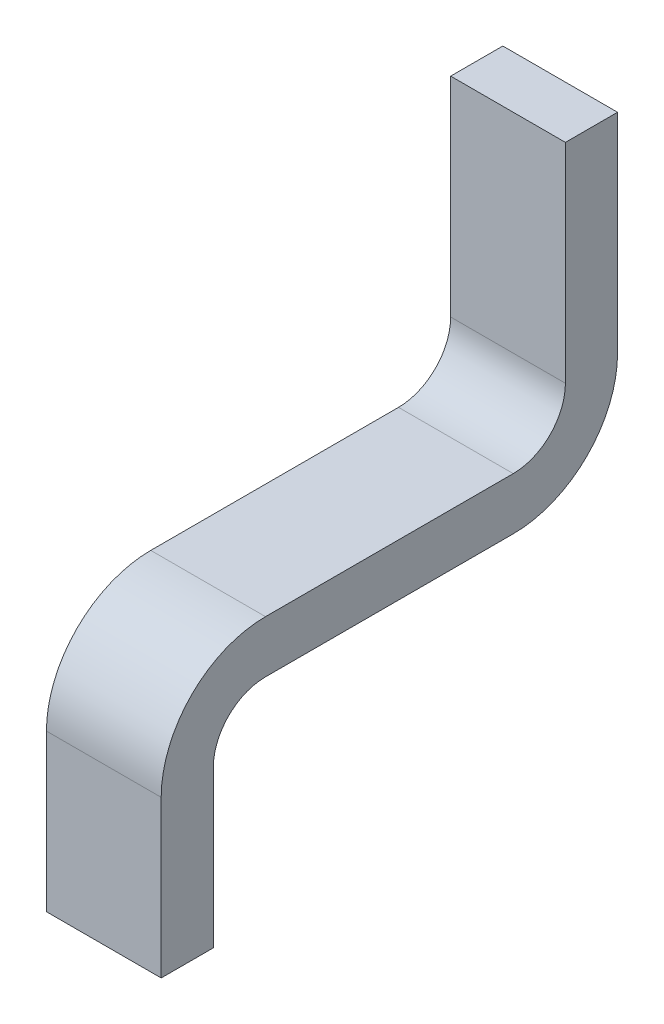
ISO-10303-21;
HEADER;
FILE_DESCRIPTION(('STEP AP214'),'2;1');
FILE_NAME('part.step','',(''),(''),'','','');
FILE_SCHEMA(('AUTOMOTIVE_DESIGN { 1 0 10303 214 1 1 1 1 }'));
ENDSEC;
DATA;
#1=APPLICATION_CONTEXT('core data for automotive mechanical design processes');
#2=APPLICATION_PROTOCOL_DEFINITION('international standard','automotive_design',2000,#1);
#3=PRODUCT_CONTEXT('',#1,'mechanical');
#4=PRODUCT('Part','Part','',(#3));
#5=PRODUCT_RELATED_PRODUCT_CATEGORY('part','',(#4));
#6=PRODUCT_DEFINITION_FORMATION('','',#4);
#7=PRODUCT_DEFINITION_CONTEXT('part definition',#1,'design');
#8=PRODUCT_DEFINITION('design','',#6,#7);
#9=PRODUCT_DEFINITION_SHAPE('','',#8);
#10=(LENGTH_UNIT() NAMED_UNIT(*) SI_UNIT(.MILLI.,.METRE.));
#11=(NAMED_UNIT(*) PLANE_ANGLE_UNIT() SI_UNIT($,.RADIAN.));
#12=(NAMED_UNIT(*) SI_UNIT($,.STERADIAN.) SOLID_ANGLE_UNIT());
#13=UNCERTAINTY_MEASURE_WITH_UNIT(LENGTH_MEASURE(1.E-05),#10,'distance_accuracy_value','');
#14=(GEOMETRIC_REPRESENTATION_CONTEXT(3) GLOBAL_UNCERTAINTY_ASSIGNED_CONTEXT((#13)) GLOBAL_UNIT_ASSIGNED_CONTEXT((#10,
#11,#12)) REPRESENTATION_CONTEXT('',''));
#15=CARTESIAN_POINT('',(0.,0.,0.));
#16=DIRECTION('',(0.,0.,1.));
#17=DIRECTION('',(1.,0.,0.));
#18=AXIS2_PLACEMENT_3D('',#15,#16,#17);
#19=CARTESIAN_POINT('',(-1.64,4.,0.675));
#20=DIRECTION('',(-1.,0.,0.));
#21=DIRECTION('',(0.,-1.,0.));
#22=AXIS2_PLACEMENT_3D('',#19,#20,#21);
#23=PLANE('',#22);
#24=CARTESIAN_POINT('',(-1.64,3.8,0.675));
#25=DIRECTION('',(1.,0.,0.));
#26=DIRECTION('',(0.,1.,0.));
#27=AXIS2_PLACEMENT_3D('',#24,#25,#26);
#28=CIRCLE('',#27,0.2);
#29=CARTESIAN_POINT('',(-1.64,3.8,0.875));
#30=VERTEX_POINT('',#29);
#31=CARTESIAN_POINT('',(-1.64,4.,0.675));
#32=VERTEX_POINT('',#31);
#33=EDGE_CURVE('E150',#30,#32,#28,.F.);
#34=ORIENTED_EDGE('',*,*,#33,.F.);
#35=DIRECTION('',(0.,1.,0.));
#36=VECTOR('',#35,1.);
#37=CARTESIAN_POINT('',(-1.64,3.50000000000001,0.875));
#38=LINE('',#37,#36);
#39=CARTESIAN_POINT('',(-1.64,3.50000000000001,0.875));
#40=VERTEX_POINT('',#39);
#41=EDGE_CURVE('E147',#30,#40,#38,.F.);
#42=ORIENTED_EDGE('',*,*,#41,.T.);
#43=DIRECTION('',(0.,0.,1.));
#44=VECTOR('',#43,1.);
#45=CARTESIAN_POINT('',(-1.64,3.50000000000001,0.775));
#46=LINE('',#45,#44);
#47=CARTESIAN_POINT('',(-1.64,3.50000000000001,0.775));
#48=VERTEX_POINT('',#47);
#49=EDGE_CURVE('E141',#48,#40,#46,.T.);
#50=ORIENTED_EDGE('',*,*,#49,.F.);
#51=DIRECTION('',(0.,1.,0.));
#52=VECTOR('',#51,1.);
#53=CARTESIAN_POINT('',(-1.64,3.50000000000001,0.775));
#54=LINE('',#53,#52);
#55=CARTESIAN_POINT('',(-1.64,3.8,0.775));
#56=VERTEX_POINT('',#55);
#57=EDGE_CURVE('E115',#48,#56,#54,.T.);
#58=ORIENTED_EDGE('',*,*,#57,.T.);
#59=CARTESIAN_POINT('',(-1.64,3.8,0.675));
#60=DIRECTION('',(1.,0.,0.));
#61=DIRECTION('',(0.,1.,0.));
#62=AXIS2_PLACEMENT_3D('',#59,#60,#61);
#63=CIRCLE('',#62,0.1);
#64=CARTESIAN_POINT('',(-1.64,3.90000000000001,0.675));
#65=VERTEX_POINT('',#64);
#66=EDGE_CURVE('E215',#56,#65,#63,.F.);
#67=ORIENTED_EDGE('',*,*,#66,.T.);
#68=DIRECTION('',(0.,0.,1.));
#69=VECTOR('',#68,1.);
#70=CARTESIAN_POINT('',(-1.64,3.90000000000001,0.675));
#71=LINE('',#70,#69);
#72=CARTESIAN_POINT('',(-1.64,3.90000000000001,0.2));
#73=VERTEX_POINT('',#72);
#74=EDGE_CURVE('E181',#65,#73,#71,.F.);
#75=ORIENTED_EDGE('',*,*,#74,.T.);
#76=CARTESIAN_POINT('',(-1.64,4.1,0.2));
#77=DIRECTION('',(-1.,0.,0.));
#78=DIRECTION('',(0.,-1.,0.));
#79=AXIS2_PLACEMENT_3D('',#76,#77,#78);
#80=CIRCLE('',#79,0.2);
#81=CARTESIAN_POINT('',(-1.64,4.1,0.));
#82=VERTEX_POINT('',#81);
#83=EDGE_CURVE('E20',#82,#73,#80,.T.);
#84=ORIENTED_EDGE('',*,*,#83,.F.);
#85=DIRECTION('',(0.,1.,0.));
#86=VECTOR('',#85,1.);
#87=CARTESIAN_POINT('',(-1.64,4.1,0.));
#88=LINE('',#87,#86);
#89=CARTESIAN_POINT('',(-1.64,4.5,0.));
#90=VERTEX_POINT('',#89);
#91=EDGE_CURVE('E91',#82,#90,#88,.T.);
#92=ORIENTED_EDGE('',*,*,#91,.T.);
#93=DIRECTION('',(0.,0.,1.));
#94=VECTOR('',#93,1.);
#95=CARTESIAN_POINT('',(-1.64,4.5,0.));
#96=LINE('',#95,#94);
#97=CARTESIAN_POINT('',(-1.64,4.5,0.1));
#98=VERTEX_POINT('',#97);
#99=EDGE_CURVE('E163',#90,#98,#96,.T.);
#100=ORIENTED_EDGE('',*,*,#99,.T.);
#101=DIRECTION('',(0.,1.,0.));
#102=VECTOR('',#101,1.);
#103=CARTESIAN_POINT('',(-1.64,4.1,0.1));
#104=LINE('',#103,#102);
#105=CARTESIAN_POINT('',(-1.64,4.1,0.1));
#106=VERTEX_POINT('',#105);
#107=EDGE_CURVE('E159',#98,#106,#104,.F.);
#108=ORIENTED_EDGE('',*,*,#107,.T.);
#109=CARTESIAN_POINT('',(-1.64,4.1,0.2));
#110=DIRECTION('',(-1.,0.,0.));
#111=DIRECTION('',(0.,-1.,0.));
#112=AXIS2_PLACEMENT_3D('',#109,#110,#111);
#113=CIRCLE('',#112,0.1);
#114=CARTESIAN_POINT('',(-1.64,4.,0.2));
#115=VERTEX_POINT('',#114);
#116=EDGE_CURVE('E155',#106,#115,#113,.T.);
#117=ORIENTED_EDGE('',*,*,#116,.T.);
#118=DIRECTION('',(0.,0.,1.));
#119=VECTOR('',#118,1.);
#120=CARTESIAN_POINT('',(-1.64,4.,0.675));
#121=LINE('',#120,#119);
#122=EDGE_CURVE('E154',#115,#32,#121,.T.);
#123=ORIENTED_EDGE('',*,*,#122,.T.);
#124=EDGE_LOOP('',(#34,#42,#50,#58,#67,#75,#84,#92,#100,#108,#117,#123));
#125=FACE_BOUND('',#124,.T.);
#126=ADVANCED_FACE('F17',(#125),#23,.F.);
#127=CARTESIAN_POINT('',(-1.64,4.1,0.2));
#128=DIRECTION('',(-1.,0.,0.));
#129=DIRECTION('',(0.,-1.,0.));
#130=AXIS2_PLACEMENT_3D('',#127,#128,#129);
#131=CYLINDRICAL_SURFACE('',#130,0.2);
#132=CARTESIAN_POINT('',(-1.86,4.1,0.2));
#133=DIRECTION('',(-1.,0.,0.));
#134=DIRECTION('',(0.,-1.,0.));
#135=AXIS2_PLACEMENT_3D('',#132,#133,#134);
#136=CIRCLE('',#135,0.2);
#137=CARTESIAN_POINT('',(-1.86,3.9,0.2));
#138=VERTEX_POINT('',#137);
#139=CARTESIAN_POINT('',(-1.86,4.1,0.));
#140=VERTEX_POINT('',#139);
#141=EDGE_CURVE('E183',#138,#140,#136,.F.);
#142=ORIENTED_EDGE('',*,*,#141,.T.);
#143=DIRECTION('',(1.,0.,0.));
#144=VECTOR('',#143,1.);
#145=CARTESIAN_POINT('',(-1.64,4.1,0.));
#146=LINE('',#145,#144);
#147=EDGE_CURVE('E178',#140,#82,#146,.T.);
#148=ORIENTED_EDGE('',*,*,#147,.T.);
#149=ORIENTED_EDGE('',*,*,#83,.T.);
#150=DIRECTION('',(-1.,0.,0.));
#151=VECTOR('',#150,1.);
#152=CARTESIAN_POINT('',(-1.64,3.90000000000001,0.2));
#153=LINE('',#152,#151);
#154=EDGE_CURVE('E217',#73,#138,#153,.T.);
#155=ORIENTED_EDGE('',*,*,#154,.T.);
#156=EDGE_LOOP('',(#142,#148,#149,#155));
#157=FACE_BOUND('',#156,.T.);
#158=ADVANCED_FACE('F254',(#157),#131,.T.);
#159=CARTESIAN_POINT('',(-1.64,4.1,0.));
#160=DIRECTION('',(0.,0.,1.));
#161=DIRECTION('',(1.,0.,0.));
#162=AXIS2_PLACEMENT_3D('',#159,#160,#161);
#163=PLANE('',#162);
#164=ORIENTED_EDGE('',*,*,#147,.F.);
#165=DIRECTION('',(0.,1.,0.));
#166=VECTOR('',#165,1.);
#167=CARTESIAN_POINT('',(-1.86,3.9,0.));
#168=LINE('',#167,#166);
#169=CARTESIAN_POINT('',(-1.86,4.5,0.));
#170=VERTEX_POINT('',#169);
#171=EDGE_CURVE('E170',#140,#170,#168,.T.);
#172=ORIENTED_EDGE('',*,*,#171,.T.);
#173=DIRECTION('',(1.,0.,0.));
#174=VECTOR('',#173,1.);
#175=CARTESIAN_POINT('',(-1.64,4.5,0.));
#176=LINE('',#175,#174);
#177=EDGE_CURVE('E173',#170,#90,#176,.T.);
#178=ORIENTED_EDGE('',*,*,#177,.T.);
#179=ORIENTED_EDGE('',*,*,#91,.F.);
#180=EDGE_LOOP('',(#164,#172,#178,#179));
#181=FACE_BOUND('',#180,.T.);
#182=ADVANCED_FACE('F257',(#181),#163,.F.);
#183=CARTESIAN_POINT('',(-1.64,4.5,0.));
#184=DIRECTION('',(0.,-1.,0.));
#185=DIRECTION('',(1.,0.,0.));
#186=AXIS2_PLACEMENT_3D('',#183,#184,#185);
#187=PLANE('',#186);
#188=DIRECTION('',(-1.,0.,0.));
#189=VECTOR('',#188,1.);
#190=CARTESIAN_POINT('',(-1.86,4.5,0.1));
#191=LINE('',#190,#189);
#192=CARTESIAN_POINT('',(-1.86,4.5,0.1));
#193=VERTEX_POINT('',#192);
#194=EDGE_CURVE('E160',#193,#98,#191,.F.);
#195=ORIENTED_EDGE('',*,*,#194,.T.);
#196=ORIENTED_EDGE('',*,*,#99,.F.);
#197=ORIENTED_EDGE('',*,*,#177,.F.);
#198=DIRECTION('',(0.,0.,1.));
#199=VECTOR('',#198,1.);
#200=CARTESIAN_POINT('',(-1.86,4.5,0.675));
#201=LINE('',#200,#199);
#202=EDGE_CURVE('E166',#170,#193,#201,.T.);
#203=ORIENTED_EDGE('',*,*,#202,.T.);
#204=EDGE_LOOP('',(#195,#196,#197,#203));
#205=FACE_BOUND('',#204,.T.);
#206=ADVANCED_FACE('F259',(#205),#187,.F.);
#207=CARTESIAN_POINT('',(-1.86,4.1,0.1));
#208=DIRECTION('',(0.,0.,-1.));
#209=DIRECTION('',(-1.,0.,0.));
#210=AXIS2_PLACEMENT_3D('',#207,#208,#209);
#211=PLANE('',#210);
#212=DIRECTION('',(-1.,0.,0.));
#213=VECTOR('',#212,1.);
#214=CARTESIAN_POINT('',(-1.86,4.1,0.1));
#215=LINE('',#214,#213);
#216=CARTESIAN_POINT('',(-1.86,4.1,0.1));
#217=VERTEX_POINT('',#216);
#218=EDGE_CURVE('E156',#217,#106,#215,.F.);
#219=ORIENTED_EDGE('',*,*,#218,.T.);
#220=ORIENTED_EDGE('',*,*,#107,.F.);
#221=ORIENTED_EDGE('',*,*,#194,.F.);
#222=DIRECTION('',(0.,1.,0.));
#223=VECTOR('',#222,1.);
#224=CARTESIAN_POINT('',(-1.86,3.9,0.1));
#225=LINE('',#224,#223);
#226=EDGE_CURVE('E169',#193,#217,#225,.F.);
#227=ORIENTED_EDGE('',*,*,#226,.T.);
#228=EDGE_LOOP('',(#219,#220,#221,#227));
#229=FACE_BOUND('',#228,.T.);
#230=ADVANCED_FACE('F234',(#229),#211,.F.);
#231=CARTESIAN_POINT('',(-1.86,4.1,0.2));
#232=DIRECTION('',(-1.,0.,0.));
#233=DIRECTION('',(0.,-1.,0.));
#234=AXIS2_PLACEMENT_3D('',#231,#232,#233);
#235=CYLINDRICAL_SURFACE('',#234,0.1);
#236=DIRECTION('',(1.,0.,0.));
#237=VECTOR('',#236,1.);
#238=CARTESIAN_POINT('',(-1.86,4.,0.2));
#239=LINE('',#238,#237);
#240=CARTESIAN_POINT('',(-1.86,4.,0.2));
#241=VERTEX_POINT('',#240);
#242=EDGE_CURVE('E151',#241,#115,#239,.T.);
#243=ORIENTED_EDGE('',*,*,#242,.T.);
#244=ORIENTED_EDGE('',*,*,#116,.F.);
#245=ORIENTED_EDGE('',*,*,#218,.F.);
#246=CARTESIAN_POINT('',(-1.86,4.1,0.2));
#247=DIRECTION('',(-1.,0.,0.));
#248=DIRECTION('',(0.,-1.,0.));
#249=AXIS2_PLACEMENT_3D('',#246,#247,#248);
#250=CIRCLE('',#249,0.1);
#251=EDGE_CURVE('E210',#217,#241,#250,.T.);
#252=ORIENTED_EDGE('',*,*,#251,.T.);
#253=EDGE_LOOP('',(#243,#244,#245,#252));
#254=FACE_BOUND('',#253,.T.);
#255=ADVANCED_FACE('F227',(#254),#235,.F.);
#256=CARTESIAN_POINT('',(-1.86,4.,0.675));
#257=DIRECTION('',(0.,-1.,0.));
#258=DIRECTION('',(1.,0.,0.));
#259=AXIS2_PLACEMENT_3D('',#256,#257,#258);
#260=PLANE('',#259);
#261=DIRECTION('',(1.,0.,0.));
#262=VECTOR('',#261,1.);
#263=CARTESIAN_POINT('',(-1.86,4.,0.675));
#264=LINE('',#263,#262);
#265=CARTESIAN_POINT('',(-1.86,4.,0.675));
#266=VERTEX_POINT('',#265);
#267=EDGE_CURVE('E148',#32,#266,#264,.F.);
#268=ORIENTED_EDGE('',*,*,#267,.F.);
#269=ORIENTED_EDGE('',*,*,#122,.F.);
#270=ORIENTED_EDGE('',*,*,#242,.F.);
#271=DIRECTION('',(0.,0.,1.));
#272=VECTOR('',#271,1.);
#273=CARTESIAN_POINT('',(-1.86,4.,0.675));
#274=LINE('',#273,#272);
#275=EDGE_CURVE('E209',#241,#266,#274,.T.);
#276=ORIENTED_EDGE('',*,*,#275,.T.);
#277=EDGE_LOOP('',(#268,#269,#270,#276));
#278=FACE_BOUND('',#277,.T.);
#279=ADVANCED_FACE('F224',(#278),#260,.F.);
#280=CARTESIAN_POINT('',(-1.86,3.8,0.675));
#281=DIRECTION('',(1.,0.,0.));
#282=DIRECTION('',(0.,1.,0.));
#283=AXIS2_PLACEMENT_3D('',#280,#281,#282);
#284=CYLINDRICAL_SURFACE('',#283,0.2);
#285=ORIENTED_EDGE('',*,*,#33,.T.);
#286=ORIENTED_EDGE('',*,*,#267,.T.);
#287=CARTESIAN_POINT('',(-1.86,3.8,0.675));
#288=DIRECTION('',(1.,0.,0.));
#289=DIRECTION('',(0.,1.,0.));
#290=AXIS2_PLACEMENT_3D('',#287,#288,#289);
#291=CIRCLE('',#290,0.2);
#292=CARTESIAN_POINT('',(-1.86,3.8,0.875));
#293=VERTEX_POINT('',#292);
#294=EDGE_CURVE('E133',#266,#293,#291,.T.);
#295=ORIENTED_EDGE('',*,*,#294,.T.);
#296=DIRECTION('',(-1.,0.,0.));
#297=VECTOR('',#296,1.);
#298=CARTESIAN_POINT('',(-1.86,3.8,0.875));
#299=LINE('',#298,#297);
#300=EDGE_CURVE('E144',#293,#30,#299,.F.);
#301=ORIENTED_EDGE('',*,*,#300,.T.);
#302=EDGE_LOOP('',(#285,#286,#295,#301));
#303=FACE_BOUND('',#302,.T.);
#304=ADVANCED_FACE('F285',(#303),#284,.T.);
#305=CARTESIAN_POINT('',(-1.86,3.50000000000001,0.875));
#306=DIRECTION('',(0.,0.,-1.));
#307=DIRECTION('',(-1.,0.,0.));
#308=AXIS2_PLACEMENT_3D('',#305,#306,#307);
#309=PLANE('',#308);
#310=DIRECTION('',(1.,0.,0.));
#311=VECTOR('',#310,1.);
#312=CARTESIAN_POINT('',(-1.64,3.50000000000001,0.875));
#313=LINE('',#312,#311);
#314=CARTESIAN_POINT('',(-1.86,3.50000000000001,0.875));
#315=VERTEX_POINT('',#314);
#316=EDGE_CURVE('E118',#40,#315,#313,.F.);
#317=ORIENTED_EDGE('',*,*,#316,.F.);
#318=ORIENTED_EDGE('',*,*,#41,.F.);
#319=ORIENTED_EDGE('',*,*,#300,.F.);
#320=DIRECTION('',(0.,1.,0.));
#321=VECTOR('',#320,1.);
#322=CARTESIAN_POINT('',(-1.86,3.9,0.875));
#323=LINE('',#322,#321);
#324=EDGE_CURVE('E131',#293,#315,#323,.F.);
#325=ORIENTED_EDGE('',*,*,#324,.T.);
#326=EDGE_LOOP('',(#317,#318,#319,#325));
#327=FACE_BOUND('',#326,.T.);
#328=ADVANCED_FACE('F282',(#327),#309,.F.);
#329=CARTESIAN_POINT('',(-1.64,3.50000000000001,0.775));
#330=DIRECTION('',(0.,-1.,0.));
#331=DIRECTION('',(1.,0.,0.));
#332=AXIS2_PLACEMENT_3D('',#329,#330,#331);
#333=PLANE('',#332);
#334=ORIENTED_EDGE('',*,*,#49,.T.);
#335=ORIENTED_EDGE('',*,*,#316,.T.);
#336=DIRECTION('',(0.,0.,1.));
#337=VECTOR('',#336,1.);
#338=CARTESIAN_POINT('',(-1.86,3.50000000000001,0.675));
#339=LINE('',#338,#337);
#340=CARTESIAN_POINT('',(-1.86,3.50000000000001,0.775));
#341=VERTEX_POINT('',#340);
#342=EDGE_CURVE('E125',#315,#341,#339,.F.);
#343=ORIENTED_EDGE('',*,*,#342,.T.);
#344=DIRECTION('',(1.,0.,0.));
#345=VECTOR('',#344,1.);
#346=CARTESIAN_POINT('',(-1.64,3.50000000000001,0.775));
#347=LINE('',#346,#345);
#348=EDGE_CURVE('E110',#341,#48,#347,.T.);
#349=ORIENTED_EDGE('',*,*,#348,.T.);
#350=EDGE_LOOP('',(#334,#335,#343,#349));
#351=FACE_BOUND('',#350,.T.);
#352=ADVANCED_FACE('F129',(#351),#333,.T.);
#353=CARTESIAN_POINT('',(-1.64,3.50000000000001,0.775));
#354=DIRECTION('',(0.,0.,1.));
#355=DIRECTION('',(1.,0.,0.));
#356=AXIS2_PLACEMENT_3D('',#353,#354,#355);
#357=PLANE('',#356);
#358=ORIENTED_EDGE('',*,*,#348,.F.);
#359=DIRECTION('',(0.,1.,0.));
#360=VECTOR('',#359,1.);
#361=CARTESIAN_POINT('',(-1.86,3.9,0.775));
#362=LINE('',#361,#360);
#363=CARTESIAN_POINT('',(-1.86,3.8,0.775));
#364=VERTEX_POINT('',#363);
#365=EDGE_CURVE('E114',#341,#364,#362,.T.);
#366=ORIENTED_EDGE('',*,*,#365,.T.);
#367=DIRECTION('',(1.,0.,0.));
#368=VECTOR('',#367,1.);
#369=CARTESIAN_POINT('',(-1.64,3.8,0.775));
#370=LINE('',#369,#368);
#371=EDGE_CURVE('E185',#364,#56,#370,.T.);
#372=ORIENTED_EDGE('',*,*,#371,.T.);
#373=ORIENTED_EDGE('',*,*,#57,.F.);
#374=EDGE_LOOP('',(#358,#366,#372,#373));
#375=FACE_BOUND('',#374,.T.);
#376=ADVANCED_FACE('F112',(#375),#357,.F.);
#377=CARTESIAN_POINT('',(-1.64,3.8,0.675));
#378=DIRECTION('',(1.,0.,0.));
#379=DIRECTION('',(0.,1.,0.));
#380=AXIS2_PLACEMENT_3D('',#377,#378,#379);
#381=CYLINDRICAL_SURFACE('',#380,0.1);
#382=ORIENTED_EDGE('',*,*,#371,.F.);
#383=CARTESIAN_POINT('',(-1.86,3.8,0.675));
#384=DIRECTION('',(1.,0.,0.));
#385=DIRECTION('',(0.,1.,0.));
#386=AXIS2_PLACEMENT_3D('',#383,#384,#385);
#387=CIRCLE('',#386,0.1);
#388=CARTESIAN_POINT('',(-1.86,3.9,0.675));
#389=VERTEX_POINT('',#388);
#390=EDGE_CURVE('E26',#364,#389,#387,.F.);
#391=ORIENTED_EDGE('',*,*,#390,.T.);
#392=DIRECTION('',(-1.,0.,0.));
#393=VECTOR('',#392,1.);
#394=CARTESIAN_POINT('',(-1.64,3.90000000000001,0.675));
#395=LINE('',#394,#393);
#396=EDGE_CURVE('E34',#389,#65,#395,.F.);
#397=ORIENTED_EDGE('',*,*,#396,.T.);
#398=ORIENTED_EDGE('',*,*,#66,.F.);
#399=EDGE_LOOP('',(#382,#391,#397,#398));
#400=FACE_BOUND('',#399,.T.);
#401=ADVANCED_FACE('F250',(#400),#381,.F.);
#402=CARTESIAN_POINT('',(-1.64,3.90000000000001,0.675));
#403=DIRECTION('',(0.,1.,0.));
#404=DIRECTION('',(-1.,0.,0.));
#405=AXIS2_PLACEMENT_3D('',#402,#403,#404);
#406=PLANE('',#405);
#407=ORIENTED_EDGE('',*,*,#396,.F.);
#408=DIRECTION('',(0.,0.,1.));
#409=VECTOR('',#408,1.);
#410=CARTESIAN_POINT('',(-1.86,3.9,0.675));
#411=LINE('',#410,#409);
#412=EDGE_CURVE('E11',#389,#138,#411,.F.);
#413=ORIENTED_EDGE('',*,*,#412,.T.);
#414=ORIENTED_EDGE('',*,*,#154,.F.);
#415=ORIENTED_EDGE('',*,*,#74,.F.);
#416=EDGE_LOOP('',(#407,#413,#414,#415));
#417=FACE_BOUND('',#416,.T.);
#418=ADVANCED_FACE('F252',(#417),#406,.F.);
#419=CARTESIAN_POINT('',(-1.86,3.9,0.675));
#420=DIRECTION('',(1.,0.,0.));
#421=DIRECTION('',(0.,1.,0.));
#422=AXIS2_PLACEMENT_3D('',#419,#420,#421);
#423=PLANE('',#422);
#424=ORIENTED_EDGE('',*,*,#390,.F.);
#425=ORIENTED_EDGE('',*,*,#365,.F.);
#426=ORIENTED_EDGE('',*,*,#342,.F.);
#427=ORIENTED_EDGE('',*,*,#324,.F.);
#428=ORIENTED_EDGE('',*,*,#294,.F.);
#429=ORIENTED_EDGE('',*,*,#275,.F.);
#430=ORIENTED_EDGE('',*,*,#251,.F.);
#431=ORIENTED_EDGE('',*,*,#226,.F.);
#432=ORIENTED_EDGE('',*,*,#202,.F.);
#433=ORIENTED_EDGE('',*,*,#171,.F.);
#434=ORIENTED_EDGE('',*,*,#141,.F.);
#435=ORIENTED_EDGE('',*,*,#412,.F.);
#436=EDGE_LOOP('',(#424,#425,#426,#427,#428,#429,#430,#431,#432,#433,#434,#435));
#437=FACE_BOUND('',#436,.T.);
#438=ADVANCED_FACE('F123',(#437),#423,.F.);
#439=CLOSED_SHELL('',(#126,#158,#182,#206,#230,#255,#279,#304,#328,#352,#376,#401,#418,#438));
#440=MANIFOLD_SOLID_BREP('B1',#439);
#441=ADVANCED_BREP_SHAPE_REPRESENTATION('',(#18,#440),#14);
#442=SHAPE_DEFINITION_REPRESENTATION(#9,#441);
ENDSEC;
END-ISO-10303-21;
